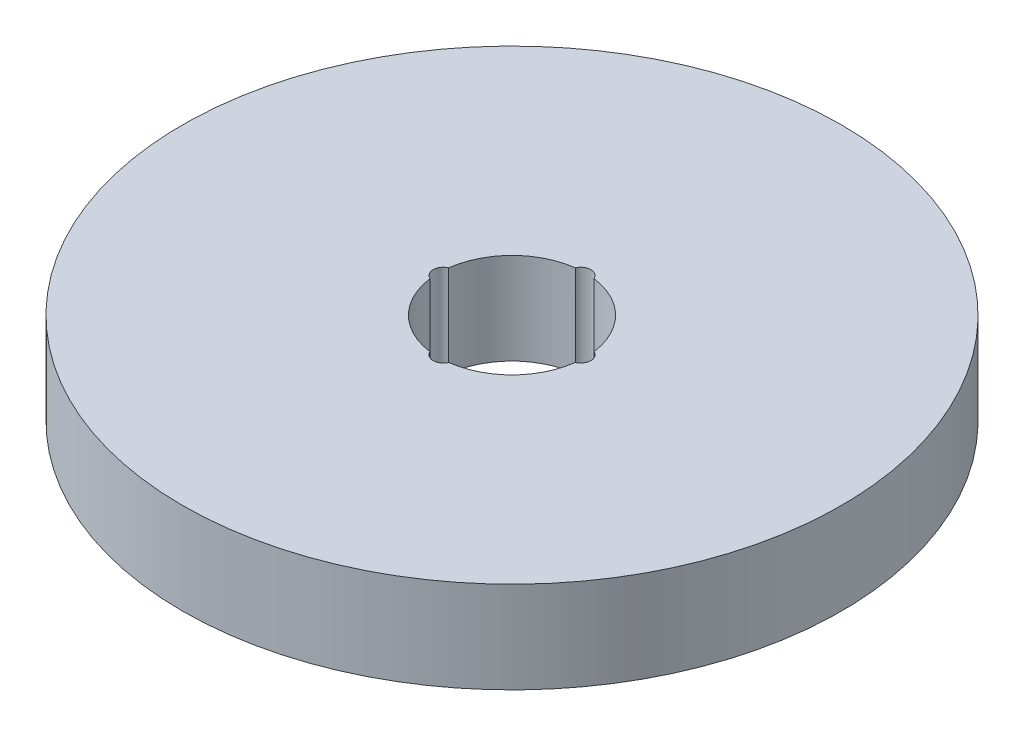
ISO-10303-21;
HEADER;
FILE_DESCRIPTION(('STEP AP214'),'2;1');
FILE_NAME('part.step','',(''),(''),'','','');
FILE_SCHEMA(('AUTOMOTIVE_DESIGN { 1 0 10303 214 1 1 1 1 }'));
ENDSEC;
DATA;
#1=APPLICATION_CONTEXT('core data for automotive mechanical design processes');
#2=APPLICATION_PROTOCOL_DEFINITION('international standard','automotive_design',2000,#1);
#3=PRODUCT_CONTEXT('',#1,'mechanical');
#4=PRODUCT('Part','Part','',(#3));
#5=PRODUCT_RELATED_PRODUCT_CATEGORY('part','',(#4));
#6=PRODUCT_DEFINITION_FORMATION('','',#4);
#7=PRODUCT_DEFINITION_CONTEXT('part definition',#1,'design');
#8=PRODUCT_DEFINITION('design','',#6,#7);
#9=PRODUCT_DEFINITION_SHAPE('','',#8);
#10=(LENGTH_UNIT() NAMED_UNIT(*) SI_UNIT(.MILLI.,.METRE.));
#11=(NAMED_UNIT(*) PLANE_ANGLE_UNIT() SI_UNIT($,.RADIAN.));
#12=(NAMED_UNIT(*) SI_UNIT($,.STERADIAN.) SOLID_ANGLE_UNIT());
#13=UNCERTAINTY_MEASURE_WITH_UNIT(LENGTH_MEASURE(1.E-05),#10,'distance_accuracy_value','');
#14=(GEOMETRIC_REPRESENTATION_CONTEXT(3) GLOBAL_UNCERTAINTY_ASSIGNED_CONTEXT((#13)) GLOBAL_UNIT_ASSIGNED_CONTEXT((#10,
#11,#12)) REPRESENTATION_CONTEXT('',''));
#15=CARTESIAN_POINT('',(0.,0.,0.));
#16=DIRECTION('',(0.,0.,1.));
#17=DIRECTION('',(1.,0.,0.));
#18=AXIS2_PLACEMENT_3D('',#15,#16,#17);
#19=CARTESIAN_POINT('',(0.,25.,0.));
#20=DIRECTION('',(0.,-1.,0.));
#21=DIRECTION('',(0.,0.,-1.));
#22=AXIS2_PLACEMENT_3D('',#19,#20,#21);
#23=CYLINDRICAL_SURFACE('',#22,90.);
#24=CARTESIAN_POINT('',(0.,25.,0.));
#25=DIRECTION('',(0.,1.,0.));
#26=DIRECTION('',(0.,0.,1.));
#27=AXIS2_PLACEMENT_3D('',#24,#25,#26);
#28=CIRCLE('',#27,90.);
#29=CARTESIAN_POINT('',(0.,25.,90.));
#30=VERTEX_POINT('',#29);
#31=EDGE_CURVE('E148',#30,#30,#28,.T.);
#32=ORIENTED_EDGE('',*,*,#31,.F.);
#33=EDGE_LOOP('',(#32));
#34=FACE_BOUND('',#33,.T.);
#35=CARTESIAN_POINT('',(0.,0.,0.));
#36=DIRECTION('',(0.,1.,0.));
#37=DIRECTION('',(0.,0.,1.));
#38=AXIS2_PLACEMENT_3D('',#35,#36,#37);
#39=CIRCLE('',#38,90.);
#40=CARTESIAN_POINT('',(0.,0.,90.));
#41=VERTEX_POINT('',#40);
#42=EDGE_CURVE('E139',#41,#41,#39,.T.);
#43=ORIENTED_EDGE('',*,*,#42,.T.);
#44=EDGE_LOOP('',(#43));
#45=FACE_BOUND('',#44,.T.);
#46=ADVANCED_FACE('F39',(#34,#45),#23,.T.);
#47=CARTESIAN_POINT('',(0.,25.,0.));
#48=DIRECTION('',(0.,1.,0.));
#49=DIRECTION('',(0.,0.,1.));
#50=AXIS2_PLACEMENT_3D('',#47,#48,#49);
#51=PLANE('',#50);
#52=CARTESIAN_POINT('',(0.,25.,18.7580281782566));
#53=DIRECTION('',(0.,1.,0.));
#54=DIRECTION('',(1.,0.,0.));
#55=AXIS2_PLACEMENT_3D('',#52,#53,#54);
#56=CIRCLE('',#55,2.77560390247475);
#57=CARTESIAN_POINT('',(-2.55782374125375,25.,19.8357641070033));
#58=VERTEX_POINT('',#57);
#59=CARTESIAN_POINT('',(2.55782374125389,25.,19.8357641070032));
#60=VERTEX_POINT('',#59);
#61=EDGE_CURVE('E175',#58,#60,#56,.T.);
#62=ORIENTED_EDGE('',*,*,#61,.F.);
#63=CARTESIAN_POINT('',(0.,25.,0.));
#64=DIRECTION('',(0.,1.,0.));
#65=DIRECTION('',(0.,0.,1.));
#66=AXIS2_PLACEMENT_3D('',#63,#64,#65);
#67=CIRCLE('',#66,20.);
#68=CARTESIAN_POINT('',(-19.8357641070032,25.,2.55782374125382));
#69=VERTEX_POINT('',#68);
#70=EDGE_CURVE('E134',#69,#58,#67,.T.);
#71=ORIENTED_EDGE('',*,*,#70,.F.);
#72=CARTESIAN_POINT('',(-18.7580281782566,25.,0.));
#73=DIRECTION('',(0.,1.,0.));
#74=DIRECTION('',(0.,0.,1.));
#75=AXIS2_PLACEMENT_3D('',#72,#73,#74);
#76=CIRCLE('',#75,2.77560390247475);
#77=CARTESIAN_POINT('',(-19.8357641070032,25.,-2.55782374125382));
#78=VERTEX_POINT('',#77);
#79=EDGE_CURVE('E143',#78,#69,#76,.T.);
#80=ORIENTED_EDGE('',*,*,#79,.F.);
#81=CARTESIAN_POINT('',(-2.55782374125403,25.,-19.8357641070032));
#82=VERTEX_POINT('',#81);
#83=EDGE_CURVE('E123',#82,#78,#67,.T.);
#84=ORIENTED_EDGE('',*,*,#83,.F.);
#85=CARTESIAN_POINT('',(-1.9647991601363E-13,25.,-18.7580281782566));
#86=DIRECTION('',(0.,1.,0.));
#87=DIRECTION('',(-1.,0.,0.));
#88=AXIS2_PLACEMENT_3D('',#85,#86,#87);
#89=CIRCLE('',#88,2.77560390247475);
#90=CARTESIAN_POINT('',(2.55782374125361,25.,-19.8357641070033));
#91=VERTEX_POINT('',#90);
#92=EDGE_CURVE('E106',#91,#82,#89,.T.);
#93=ORIENTED_EDGE('',*,*,#92,.F.);
#94=CARTESIAN_POINT('',(19.8357641070032,25.,-2.55782374125382));
#95=VERTEX_POINT('',#94);
#96=EDGE_CURVE('E125',#95,#91,#67,.T.);
#97=ORIENTED_EDGE('',*,*,#96,.F.);
#98=CARTESIAN_POINT('',(18.7580281782566,25.,0.));
#99=DIRECTION('',(0.,1.,0.));
#100=DIRECTION('',(0.,0.,-1.));
#101=AXIS2_PLACEMENT_3D('',#98,#99,#100);
#102=CIRCLE('',#101,2.77560390247475);
#103=CARTESIAN_POINT('',(19.8357641070032,25.,2.55782374125382));
#104=VERTEX_POINT('',#103);
#105=EDGE_CURVE('E286',#104,#95,#102,.T.);
#106=ORIENTED_EDGE('',*,*,#105,.F.);
#107=EDGE_CURVE('E135',#60,#104,#67,.T.);
#108=ORIENTED_EDGE('',*,*,#107,.F.);
#109=EDGE_LOOP('',(#62,#71,#80,#84,#93,#97,#106,#108));
#110=FACE_BOUND('',#109,.T.);
#111=ORIENTED_EDGE('',*,*,#31,.T.);
#112=EDGE_LOOP('',(#111));
#113=FACE_BOUND('',#112,.T.);
#114=ADVANCED_FACE('F118',(#110,#113),#51,.T.);
#115=CARTESIAN_POINT('',(0.,0.,0.));
#116=DIRECTION('',(0.,1.,0.));
#117=DIRECTION('',(0.,0.,1.));
#118=AXIS2_PLACEMENT_3D('',#115,#116,#117);
#119=PLANE('',#118);
#120=CARTESIAN_POINT('',(0.,0.,0.));
#121=DIRECTION('',(0.,1.,0.));
#122=DIRECTION('',(0.,0.,1.));
#123=AXIS2_PLACEMENT_3D('',#120,#121,#122);
#124=CIRCLE('',#123,20.);
#125=CARTESIAN_POINT('',(0.,0.,20.));
#126=VERTEX_POINT('',#125);
#127=EDGE_CURVE('E136',#126,#126,#124,.T.);
#128=ORIENTED_EDGE('',*,*,#127,.T.);
#129=EDGE_LOOP('',(#128));
#130=FACE_BOUND('',#129,.T.);
#131=ORIENTED_EDGE('',*,*,#42,.F.);
#132=EDGE_LOOP('',(#131));
#133=FACE_BOUND('',#132,.T.);
#134=ADVANCED_FACE('F187',(#130,#133),#119,.F.);
#135=CARTESIAN_POINT('',(0.,25.,0.));
#136=DIRECTION('',(0.,-1.,0.));
#137=DIRECTION('',(0.,0.,-1.));
#138=AXIS2_PLACEMENT_3D('',#135,#136,#137);
#139=CYLINDRICAL_SURFACE('',#138,20.);
#140=DIRECTION('',(0.,1.,0.));
#141=VECTOR('',#140,1.);
#142=CARTESIAN_POINT('',(-2.55782374125375,12.5816518183405,19.8357641070032));
#143=LINE('',#142,#141);
#144=CARTESIAN_POINT('',(-2.55782374125375,0.163303636681059,19.8357641070033));
#145=VERTEX_POINT('',#144);
#146=EDGE_CURVE('E11',#145,#58,#143,.T.);
#147=ORIENTED_EDGE('',*,*,#146,.F.);
#148=CARTESIAN_POINT('',(0.,0.163303636681059,0.));
#149=DIRECTION('',(0.,1.,0.));
#150=DIRECTION('',(0.,0.,1.));
#151=AXIS2_PLACEMENT_3D('',#148,#149,#150);
#152=CIRCLE('',#151,20.);
#153=CARTESIAN_POINT('',(2.55782374125389,0.163303636681059,19.8357641070032));
#154=VERTEX_POINT('',#153);
#155=EDGE_CURVE('E170',#145,#154,#152,.T.);
#156=ORIENTED_EDGE('',*,*,#155,.T.);
#157=DIRECTION('',(0.,1.,0.));
#158=VECTOR('',#157,1.);
#159=CARTESIAN_POINT('',(2.55782374125389,12.5816518183405,19.8357641070032));
#160=LINE('',#159,#158);
#161=EDGE_CURVE('E46',#60,#154,#160,.F.);
#162=ORIENTED_EDGE('',*,*,#161,.F.);
#163=ORIENTED_EDGE('',*,*,#107,.T.);
#164=DIRECTION('',(0.,1.,0.));
#165=VECTOR('',#164,1.);
#166=CARTESIAN_POINT('',(19.8357641070032,12.5816518183405,2.55782374125382));
#167=LINE('',#166,#165);
#168=CARTESIAN_POINT('',(19.8357641070032,0.163303636681059,2.55782374125382));
#169=VERTEX_POINT('',#168);
#170=EDGE_CURVE('E164',#169,#104,#167,.T.);
#171=ORIENTED_EDGE('',*,*,#170,.F.);
#172=CARTESIAN_POINT('',(0.,0.163303636681059,0.));
#173=DIRECTION('',(0.,1.,0.));
#174=DIRECTION('',(0.,0.,1.));
#175=AXIS2_PLACEMENT_3D('',#172,#173,#174);
#176=CIRCLE('',#175,20.);
#177=CARTESIAN_POINT('',(19.8357641070032,0.163303636681059,-2.55782374125382));
#178=VERTEX_POINT('',#177);
#179=EDGE_CURVE('E115',#169,#178,#176,.T.);
#180=ORIENTED_EDGE('',*,*,#179,.T.);
#181=DIRECTION('',(0.,1.,0.));
#182=VECTOR('',#181,1.);
#183=CARTESIAN_POINT('',(19.8357641070032,12.5816518183405,-2.55782374125382));
#184=LINE('',#183,#182);
#185=EDGE_CURVE('E131',#95,#178,#184,.F.);
#186=ORIENTED_EDGE('',*,*,#185,.F.);
#187=ORIENTED_EDGE('',*,*,#96,.T.);
#188=DIRECTION('',(0.,1.,0.));
#189=VECTOR('',#188,1.);
#190=CARTESIAN_POINT('',(2.55782374125361,12.5816518183405,-19.8357641070033));
#191=LINE('',#190,#189);
#192=CARTESIAN_POINT('',(2.55782374125361,0.163303636681059,-19.8357641070033));
#193=VERTEX_POINT('',#192);
#194=EDGE_CURVE('E105',#193,#91,#191,.T.);
#195=ORIENTED_EDGE('',*,*,#194,.F.);
#196=CARTESIAN_POINT('',(0.,0.163303636681059,0.));
#197=DIRECTION('',(0.,1.,0.));
#198=DIRECTION('',(0.,0.,1.));
#199=AXIS2_PLACEMENT_3D('',#196,#197,#198);
#200=CIRCLE('',#199,20.);
#201=CARTESIAN_POINT('',(-2.55782374125403,0.163303636681059,-19.8357641070032));
#202=VERTEX_POINT('',#201);
#203=EDGE_CURVE('E159',#193,#202,#200,.T.);
#204=ORIENTED_EDGE('',*,*,#203,.T.);
#205=DIRECTION('',(0.,1.,0.));
#206=VECTOR('',#205,1.);
#207=CARTESIAN_POINT('',(-2.55782374125403,12.5816518183405,-19.8357641070032));
#208=LINE('',#207,#206);
#209=EDGE_CURVE('E114',#82,#202,#208,.F.);
#210=ORIENTED_EDGE('',*,*,#209,.F.);
#211=ORIENTED_EDGE('',*,*,#83,.T.);
#212=DIRECTION('',(0.,1.,0.));
#213=VECTOR('',#212,1.);
#214=CARTESIAN_POINT('',(-19.8357641070032,12.5816518183405,-2.55782374125382));
#215=LINE('',#214,#213);
#216=CARTESIAN_POINT('',(-19.8357641070032,0.163303636681059,-2.55782374125382));
#217=VERTEX_POINT('',#216);
#218=EDGE_CURVE('E160',#217,#78,#215,.T.);
#219=ORIENTED_EDGE('',*,*,#218,.F.);
#220=CARTESIAN_POINT('',(0.,0.163303636681059,0.));
#221=DIRECTION('',(0.,1.,0.));
#222=DIRECTION('',(0.,0.,1.));
#223=AXIS2_PLACEMENT_3D('',#220,#221,#222);
#224=CIRCLE('',#223,20.);
#225=CARTESIAN_POINT('',(-19.8357641070032,0.163303636681059,2.55782374125382));
#226=VERTEX_POINT('',#225);
#227=EDGE_CURVE('E149',#217,#226,#224,.T.);
#228=ORIENTED_EDGE('',*,*,#227,.T.);
#229=DIRECTION('',(0.,1.,0.));
#230=VECTOR('',#229,1.);
#231=CARTESIAN_POINT('',(-19.8357641070032,12.5816518183405,2.55782374125382));
#232=LINE('',#231,#230);
#233=EDGE_CURVE('E152',#69,#226,#232,.F.);
#234=ORIENTED_EDGE('',*,*,#233,.F.);
#235=ORIENTED_EDGE('',*,*,#70,.T.);
#236=EDGE_LOOP('',(#147,#156,#162,#163,#171,#180,#186,#187,#195,#204,#210,#211,#219,#228,#234,#235));
#237=FACE_BOUND('',#236,.T.);
#238=ORIENTED_EDGE('',*,*,#127,.F.);
#239=EDGE_LOOP('',(#238));
#240=FACE_BOUND('',#239,.T.);
#241=ADVANCED_FACE('F126',(#237,#240),#139,.F.);
#242=CARTESIAN_POINT('',(-18.7580281782566,0.163303636681059,0.));
#243=DIRECTION('',(0.,1.,0.));
#244=DIRECTION('',(0.,0.,1.));
#245=AXIS2_PLACEMENT_3D('',#242,#243,#244);
#246=CYLINDRICAL_SURFACE('',#245,2.77560390247475);
#247=ORIENTED_EDGE('',*,*,#218,.T.);
#248=ORIENTED_EDGE('',*,*,#79,.T.);
#249=ORIENTED_EDGE('',*,*,#233,.T.);
#250=CARTESIAN_POINT('',(-18.7580281782566,0.163303636681059,0.));
#251=DIRECTION('',(0.,1.,0.));
#252=DIRECTION('',(0.,0.,1.));
#253=AXIS2_PLACEMENT_3D('',#250,#251,#252);
#254=CIRCLE('',#253,2.77560390247475);
#255=EDGE_CURVE('E144',#217,#226,#254,.T.);
#256=ORIENTED_EDGE('',*,*,#255,.F.);
#257=EDGE_LOOP('',(#247,#248,#249,#256));
#258=FACE_BOUND('',#257,.T.);
#259=ADVANCED_FACE('F200',(#258),#246,.F.);
#260=CARTESIAN_POINT('',(-18.7580281782566,0.163303636681059,0.));
#261=DIRECTION('',(0.,1.,0.));
#262=DIRECTION('',(0.,0.,1.));
#263=AXIS2_PLACEMENT_3D('',#260,#261,#262);
#264=PLANE('',#263);
#265=ORIENTED_EDGE('',*,*,#255,.T.);
#266=ORIENTED_EDGE('',*,*,#227,.F.);
#267=EDGE_LOOP('',(#265,#266));
#268=FACE_BOUND('',#267,.T.);
#269=ADVANCED_FACE('F201',(#268),#264,.T.);
#270=CARTESIAN_POINT('',(-1.9647991601363E-13,0.163303636681059,-18.7580281782566));
#271=DIRECTION('',(0.,1.,0.));
#272=DIRECTION('',(0.,0.,1.));
#273=AXIS2_PLACEMENT_3D('',#270,#271,#272);
#274=CYLINDRICAL_SURFACE('',#273,2.77560390247475);
#275=ORIENTED_EDGE('',*,*,#194,.T.);
#276=ORIENTED_EDGE('',*,*,#92,.T.);
#277=ORIENTED_EDGE('',*,*,#209,.T.);
#278=CARTESIAN_POINT('',(-1.9647991601363E-13,0.163303636681059,-18.7580281782566));
#279=DIRECTION('',(0.,1.,0.));
#280=DIRECTION('',(-1.,0.,0.));
#281=AXIS2_PLACEMENT_3D('',#278,#279,#280);
#282=CIRCLE('',#281,2.77560390247475);
#283=EDGE_CURVE('E107',#193,#202,#282,.T.);
#284=ORIENTED_EDGE('',*,*,#283,.F.);
#285=EDGE_LOOP('',(#275,#276,#277,#284));
#286=FACE_BOUND('',#285,.T.);
#287=ADVANCED_FACE('F102',(#286),#274,.F.);
#288=CARTESIAN_POINT('',(-1.9647991601363E-13,0.163303636681059,-18.7580281782566));
#289=DIRECTION('',(0.,1.,0.));
#290=DIRECTION('',(-1.,0.,0.));
#291=AXIS2_PLACEMENT_3D('',#288,#289,#290);
#292=PLANE('',#291);
#293=ORIENTED_EDGE('',*,*,#283,.T.);
#294=ORIENTED_EDGE('',*,*,#203,.F.);
#295=EDGE_LOOP('',(#293,#294));
#296=FACE_BOUND('',#295,.T.);
#297=ADVANCED_FACE('F209',(#296),#292,.T.);
#298=CARTESIAN_POINT('',(18.7580281782566,0.163303636681059,0.));
#299=DIRECTION('',(0.,1.,0.));
#300=DIRECTION('',(0.,0.,1.));
#301=AXIS2_PLACEMENT_3D('',#298,#299,#300);
#302=CYLINDRICAL_SURFACE('',#301,2.77560390247475);
#303=ORIENTED_EDGE('',*,*,#170,.T.);
#304=ORIENTED_EDGE('',*,*,#105,.T.);
#305=ORIENTED_EDGE('',*,*,#185,.T.);
#306=CARTESIAN_POINT('',(18.7580281782566,0.163303636681059,0.));
#307=DIRECTION('',(0.,1.,0.));
#308=DIRECTION('',(0.,0.,-1.));
#309=AXIS2_PLACEMENT_3D('',#306,#307,#308);
#310=CIRCLE('',#309,2.77560390247475);
#311=EDGE_CURVE('E56',#169,#178,#310,.T.);
#312=ORIENTED_EDGE('',*,*,#311,.F.);
#313=EDGE_LOOP('',(#303,#304,#305,#312));
#314=FACE_BOUND('',#313,.T.);
#315=ADVANCED_FACE('F213',(#314),#302,.F.);
#316=CARTESIAN_POINT('',(18.7580281782566,0.163303636681059,0.));
#317=DIRECTION('',(0.,1.,0.));
#318=DIRECTION('',(0.,0.,-1.));
#319=AXIS2_PLACEMENT_3D('',#316,#317,#318);
#320=PLANE('',#319);
#321=ORIENTED_EDGE('',*,*,#311,.T.);
#322=ORIENTED_EDGE('',*,*,#179,.F.);
#323=EDGE_LOOP('',(#321,#322));
#324=FACE_BOUND('',#323,.T.);
#325=ADVANCED_FACE('F179',(#324),#320,.T.);
#326=CARTESIAN_POINT('',(0.,0.163303636681059,18.7580281782566));
#327=DIRECTION('',(0.,1.,0.));
#328=DIRECTION('',(0.,0.,1.));
#329=AXIS2_PLACEMENT_3D('',#326,#327,#328);
#330=CYLINDRICAL_SURFACE('',#329,2.77560390247475);
#331=ORIENTED_EDGE('',*,*,#146,.T.);
#332=ORIENTED_EDGE('',*,*,#61,.T.);
#333=ORIENTED_EDGE('',*,*,#161,.T.);
#334=CARTESIAN_POINT('',(0.,0.163303636681059,18.7580281782566));
#335=DIRECTION('',(0.,1.,0.));
#336=DIRECTION('',(1.,0.,0.));
#337=AXIS2_PLACEMENT_3D('',#334,#335,#336);
#338=CIRCLE('',#337,2.77560390247475);
#339=EDGE_CURVE('E55',#145,#154,#338,.T.);
#340=ORIENTED_EDGE('',*,*,#339,.F.);
#341=EDGE_LOOP('',(#331,#332,#333,#340));
#342=FACE_BOUND('',#341,.T.);
#343=ADVANCED_FACE('F171',(#342),#330,.F.);
#344=CARTESIAN_POINT('',(0.,0.163303636681059,18.7580281782566));
#345=DIRECTION('',(0.,1.,0.));
#346=DIRECTION('',(1.,0.,0.));
#347=AXIS2_PLACEMENT_3D('',#344,#345,#346);
#348=PLANE('',#347);
#349=ORIENTED_EDGE('',*,*,#339,.T.);
#350=ORIENTED_EDGE('',*,*,#155,.F.);
#351=EDGE_LOOP('',(#349,#350));
#352=FACE_BOUND('',#351,.T.);
#353=ADVANCED_FACE('F173',(#352),#348,.T.);
#354=CLOSED_SHELL('',(#46,#114,#134,#241,#259,#269,#287,#297,#315,#325,#343,#353));
#355=MANIFOLD_SOLID_BREP('B2',#354);
#356=ADVANCED_BREP_SHAPE_REPRESENTATION('',(#18,#355),#14);
#357=SHAPE_DEFINITION_REPRESENTATION(#9,#356);
ENDSEC;
END-ISO-10303-21;
